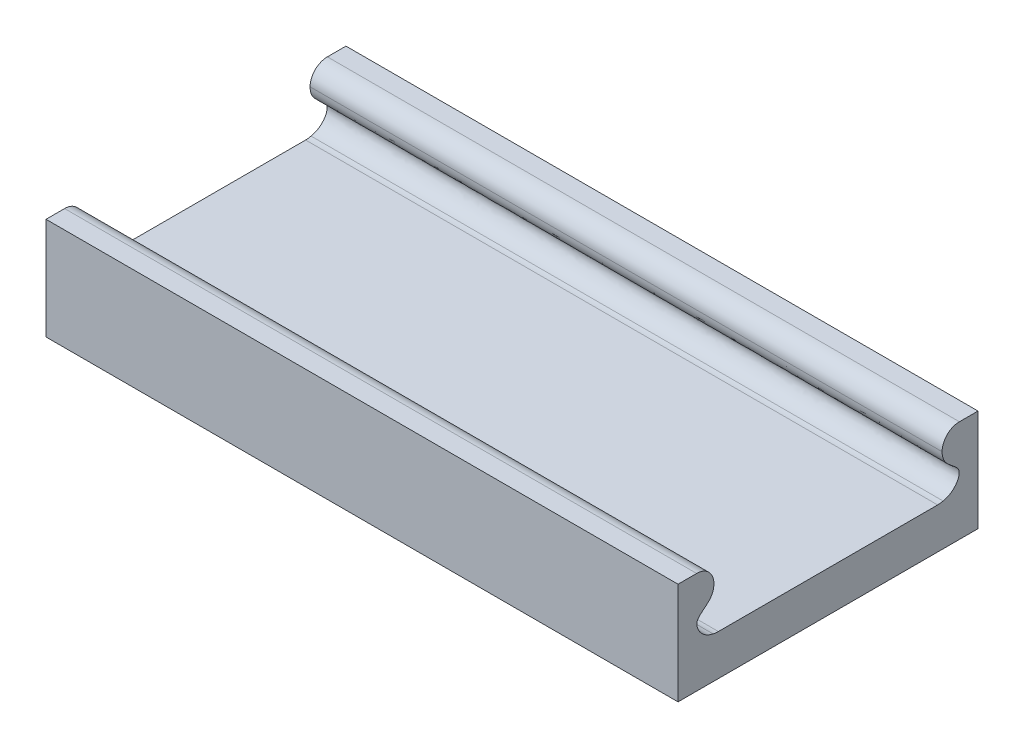
ISO-10303-21;
HEADER;
FILE_DESCRIPTION(('STEP AP214'),'2;1');
FILE_NAME('part.step','',(''),(''),'','','');
FILE_SCHEMA(('AUTOMOTIVE_DESIGN { 1 0 10303 214 1 1 1 1 }'));
ENDSEC;
DATA;
#1=APPLICATION_CONTEXT('core data for automotive mechanical design processes');
#2=APPLICATION_PROTOCOL_DEFINITION('international standard','automotive_design',2000,#1);
#3=PRODUCT_CONTEXT('',#1,'mechanical');
#4=PRODUCT('Part','Part','',(#3));
#5=PRODUCT_RELATED_PRODUCT_CATEGORY('part','',(#4));
#6=PRODUCT_DEFINITION_FORMATION('','',#4);
#7=PRODUCT_DEFINITION_CONTEXT('part definition',#1,'design');
#8=PRODUCT_DEFINITION('design','',#6,#7);
#9=PRODUCT_DEFINITION_SHAPE('','',#8);
#10=(LENGTH_UNIT() NAMED_UNIT(*) SI_UNIT(.MILLI.,.METRE.));
#11=(NAMED_UNIT(*) PLANE_ANGLE_UNIT() SI_UNIT($,.RADIAN.));
#12=(NAMED_UNIT(*) SI_UNIT($,.STERADIAN.) SOLID_ANGLE_UNIT());
#13=UNCERTAINTY_MEASURE_WITH_UNIT(LENGTH_MEASURE(1.E-05),#10,'distance_accuracy_value','');
#14=(GEOMETRIC_REPRESENTATION_CONTEXT(3) GLOBAL_UNCERTAINTY_ASSIGNED_CONTEXT((#13)) GLOBAL_UNIT_ASSIGNED_CONTEXT((#10,
#11,#12)) REPRESENTATION_CONTEXT('',''));
#15=CARTESIAN_POINT('',(0.,0.,0.));
#16=DIRECTION('',(0.,0.,1.));
#17=DIRECTION('',(1.,0.,0.));
#18=AXIS2_PLACEMENT_3D('',#15,#16,#17);
#19=CARTESIAN_POINT('',(73.824999924,9.88644672571332,15.3458333333333));
#20=DIRECTION('',(-1.,0.,0.));
#21=DIRECTION('',(0.,0.,1.));
#22=AXIS2_PLACEMENT_3D('',#19,#20,#21);
#23=CYLINDRICAL_SURFACE('',#22,2.01980327428668);
#24=CARTESIAN_POINT('',(0.,9.88644672571332,15.3458333333333));
#25=DIRECTION('',(1.,0.,0.));
#26=DIRECTION('',(0.,0.,-1.));
#27=AXIS2_PLACEMENT_3D('',#24,#25,#26);
#28=CIRCLE('',#27,2.01980327428668);
#29=CARTESIAN_POINT('',(0.,11.90625,15.3458333333333));
#30=VERTEX_POINT('',#29);
#31=CARTESIAN_POINT('',(0.,9.88644672571332,13.3260300590466));
#32=VERTEX_POINT('',#31);
#33=EDGE_CURVE('E191',#30,#32,#28,.F.);
#34=ORIENTED_EDGE('',*,*,#33,.F.);
#35=DIRECTION('',(-1.,0.,0.));
#36=VECTOR('',#35,1.);
#37=CARTESIAN_POINT('',(73.824999924,11.90625,15.3458333333333));
#38=LINE('',#37,#36);
#39=CARTESIAN_POINT('',(73.824999924,11.90625,15.3458333333333));
#40=VERTEX_POINT('',#39);
#41=EDGE_CURVE('E233',#40,#30,#38,.T.);
#42=ORIENTED_EDGE('',*,*,#41,.F.);
#43=CARTESIAN_POINT('',(73.824999924,9.88644672571332,15.3458333333333));
#44=DIRECTION('',(1.,0.,0.));
#45=DIRECTION('',(0.,0.,-1.));
#46=AXIS2_PLACEMENT_3D('',#43,#44,#45);
#47=CIRCLE('',#46,2.01980327428668);
#48=CARTESIAN_POINT('',(73.824999924,9.88644672571332,13.3260300590466));
#49=VERTEX_POINT('',#48);
#50=EDGE_CURVE('E147',#40,#49,#47,.F.);
#51=ORIENTED_EDGE('',*,*,#50,.T.);
#52=DIRECTION('',(-1.,0.,0.));
#53=VECTOR('',#52,1.);
#54=CARTESIAN_POINT('',(73.824999924,9.88644672571332,13.3260300590466));
#55=LINE('',#54,#53);
#56=EDGE_CURVE('E215',#49,#32,#55,.T.);
#57=ORIENTED_EDGE('',*,*,#56,.T.);
#58=EDGE_LOOP('',(#34,#42,#51,#57));
#59=FACE_BOUND('',#58,.T.);
#60=ADVANCED_FACE('F38',(#59),#23,.T.);
#61=CARTESIAN_POINT('',(73.824999924,11.90625,0.));
#62=DIRECTION('',(0.,1.,0.));
#63=DIRECTION('',(0.,0.,1.));
#64=AXIS2_PLACEMENT_3D('',#61,#62,#63);
#65=PLANE('',#64);
#66=DIRECTION('',(1.,0.,0.));
#67=VECTOR('',#66,1.);
#68=CARTESIAN_POINT('',(-3.17500007600001,11.90625,17.51875));
#69=LINE('',#68,#67);
#70=CARTESIAN_POINT('',(0.,11.90625,17.51875));
#71=VERTEX_POINT('',#70);
#72=CARTESIAN_POINT('',(73.824999924,11.90625,17.51875));
#73=VERTEX_POINT('',#72);
#74=EDGE_CURVE('E52',#71,#73,#69,.T.);
#75=ORIENTED_EDGE('',*,*,#74,.T.);
#76=DIRECTION('',(0.,0.,-1.));
#77=VECTOR('',#76,1.);
#78=CARTESIAN_POINT('',(73.824999924,11.90625,0.));
#79=LINE('',#78,#77);
#80=EDGE_CURVE('E139',#73,#40,#79,.T.);
#81=ORIENTED_EDGE('',*,*,#80,.T.);
#82=ORIENTED_EDGE('',*,*,#41,.T.);
#83=DIRECTION('',(0.,0.,-1.));
#84=VECTOR('',#83,1.);
#85=CARTESIAN_POINT('',(0.,11.90625,0.));
#86=LINE('',#85,#84);
#87=EDGE_CURVE('E190',#71,#30,#86,.T.);
#88=ORIENTED_EDGE('',*,*,#87,.F.);
#89=EDGE_LOOP('',(#75,#81,#82,#88));
#90=FACE_BOUND('',#89,.T.);
#91=ADVANCED_FACE('F180',(#90),#65,.T.);
#92=CARTESIAN_POINT('',(73.824999924,0.,0.));
#93=DIRECTION('',(0.,1.,0.));
#94=DIRECTION('',(0.,0.,1.));
#95=AXIS2_PLACEMENT_3D('',#92,#93,#94);
#96=PLANE('',#95);
#97=DIRECTION('',(0.,0.,-1.));
#98=VECTOR('',#97,1.);
#99=CARTESIAN_POINT('',(73.824999924,0.,0.));
#100=LINE('',#99,#98);
#101=CARTESIAN_POINT('',(73.824999924,0.,17.51875));
#102=VERTEX_POINT('',#101);
#103=CARTESIAN_POINT('',(73.824999924,0.,-17.51875));
#104=VERTEX_POINT('',#103);
#105=EDGE_CURVE('E137',#102,#104,#100,.T.);
#106=ORIENTED_EDGE('',*,*,#105,.F.);
#107=DIRECTION('',(1.,0.,0.));
#108=VECTOR('',#107,1.);
#109=CARTESIAN_POINT('',(-3.17500007600001,0.,17.51875));
#110=LINE('',#109,#108);
#111=CARTESIAN_POINT('',(0.,0.,17.51875));
#112=VERTEX_POINT('',#111);
#113=EDGE_CURVE('E123',#112,#102,#110,.T.);
#114=ORIENTED_EDGE('',*,*,#113,.F.);
#115=DIRECTION('',(0.,0.,-1.));
#116=VECTOR('',#115,1.);
#117=CARTESIAN_POINT('',(0.,0.,0.));
#118=LINE('',#117,#116);
#119=CARTESIAN_POINT('',(0.,0.,-17.51875));
#120=VERTEX_POINT('',#119);
#121=EDGE_CURVE('E237',#112,#120,#118,.T.);
#122=ORIENTED_EDGE('',*,*,#121,.T.);
#123=DIRECTION('',(1.,0.,0.));
#124=VECTOR('',#123,1.);
#125=CARTESIAN_POINT('',(-3.17500007600001,0.,-17.51875));
#126=LINE('',#125,#124);
#127=EDGE_CURVE('E59',#120,#104,#126,.T.);
#128=ORIENTED_EDGE('',*,*,#127,.T.);
#129=EDGE_LOOP('',(#106,#114,#122,#128));
#130=FACE_BOUND('',#129,.T.);
#131=ADVANCED_FACE('F141',(#130),#96,.F.);
#132=CARTESIAN_POINT('',(73.824999924,11.90625,0.));
#133=DIRECTION('',(0.,1.,0.));
#134=DIRECTION('',(0.,0.,1.));
#135=AXIS2_PLACEMENT_3D('',#132,#133,#134);
#136=PLANE('',#135);
#137=DIRECTION('',(1.,0.,0.));
#138=VECTOR('',#137,1.);
#139=CARTESIAN_POINT('',(-3.17500007600001,11.90625,-17.51875));
#140=LINE('',#139,#138);
#141=CARTESIAN_POINT('',(0.,11.90625,-17.51875));
#142=VERTEX_POINT('',#141);
#143=CARTESIAN_POINT('',(73.824999924,11.90625,-17.51875));
#144=VERTEX_POINT('',#143);
#145=EDGE_CURVE('E198',#142,#144,#140,.T.);
#146=ORIENTED_EDGE('',*,*,#145,.F.);
#147=DIRECTION('',(0.,0.,-1.));
#148=VECTOR('',#147,1.);
#149=CARTESIAN_POINT('',(0.,11.90625,0.));
#150=LINE('',#149,#148);
#151=CARTESIAN_POINT('',(0.,11.90625,-15.3458333333333));
#152=VERTEX_POINT('',#151);
#153=EDGE_CURVE('E240',#152,#142,#150,.T.);
#154=ORIENTED_EDGE('',*,*,#153,.F.);
#155=DIRECTION('',(-1.,0.,0.));
#156=VECTOR('',#155,1.);
#157=CARTESIAN_POINT('',(73.824999924,11.90625,-15.3458333333333));
#158=LINE('',#157,#156);
#159=CARTESIAN_POINT('',(73.824999924,11.90625,-15.3458333333333));
#160=VERTEX_POINT('',#159);
#161=EDGE_CURVE('E231',#160,#152,#158,.T.);
#162=ORIENTED_EDGE('',*,*,#161,.F.);
#163=DIRECTION('',(0.,0.,-1.));
#164=VECTOR('',#163,1.);
#165=CARTESIAN_POINT('',(73.824999924,11.90625,0.));
#166=LINE('',#165,#164);
#167=EDGE_CURVE('E142',#160,#144,#166,.T.);
#168=ORIENTED_EDGE('',*,*,#167,.T.);
#169=EDGE_LOOP('',(#146,#154,#162,#168));
#170=FACE_BOUND('',#169,.T.);
#171=ADVANCED_FACE('F174',(#170),#136,.T.);
#172=CARTESIAN_POINT('',(73.824999924,9.88644672571331,-15.3458333333333));
#173=DIRECTION('',(-1.,0.,0.));
#174=DIRECTION('',(0.,0.,1.));
#175=AXIS2_PLACEMENT_3D('',#172,#173,#174);
#176=CYLINDRICAL_SURFACE('',#175,2.01980327428668);
#177=CARTESIAN_POINT('',(0.,9.88644672571331,-15.3458333333333));
#178=DIRECTION('',(1.,0.,0.));
#179=DIRECTION('',(0.,0.,-1.));
#180=AXIS2_PLACEMENT_3D('',#177,#178,#179);
#181=CIRCLE('',#180,2.01980327428668);
#182=CARTESIAN_POINT('',(0.,9.88644672571332,-13.3260300590467));
#183=VERTEX_POINT('',#182);
#184=EDGE_CURVE('E243',#152,#183,#181,.T.);
#185=ORIENTED_EDGE('',*,*,#184,.T.);
#186=DIRECTION('',(-1.,0.,0.));
#187=VECTOR('',#186,1.);
#188=CARTESIAN_POINT('',(73.824999924,9.88644672571332,-13.3260300590467));
#189=LINE('',#188,#187);
#190=CARTESIAN_POINT('',(73.824999924,9.88644672571332,-13.3260300590467));
#191=VERTEX_POINT('',#190);
#192=EDGE_CURVE('E229',#191,#183,#189,.T.);
#193=ORIENTED_EDGE('',*,*,#192,.F.);
#194=CARTESIAN_POINT('',(73.824999924,9.88644672571331,-15.3458333333333));
#195=DIRECTION('',(1.,0.,0.));
#196=DIRECTION('',(0.,0.,-1.));
#197=AXIS2_PLACEMENT_3D('',#194,#195,#196);
#198=CIRCLE('',#197,2.01980327428668);
#199=EDGE_CURVE('E145',#160,#191,#198,.T.);
#200=ORIENTED_EDGE('',*,*,#199,.F.);
#201=ORIENTED_EDGE('',*,*,#161,.T.);
#202=EDGE_LOOP('',(#185,#193,#200,#201));
#203=FACE_BOUND('',#202,.T.);
#204=ADVANCED_FACE('F169',(#203),#176,.T.);
#205=CARTESIAN_POINT('',(73.824999924,4.84092627826629,-13.4282993696445));
#206=CARTESIAN_POINT('',(73.824999924,4.89728990837309,-13.7486767336852));
#207=CARTESIAN_POINT('',(73.824999924,5.11218530328561,-14.2862371792175));
#208=CARTESIAN_POINT('',(73.824999924,5.68271698665262,-14.9246676769609));
#209=CARTESIAN_POINT('',(73.824999924,6.32172282886224,-15.3058245681089));
#210=CARTESIAN_POINT('',(73.824999924,7.16334296254227,-15.3572432618043));
#211=CARTESIAN_POINT('',(73.824999924,8.14040605813312,-14.2238749566187));
#212=CARTESIAN_POINT('',(73.824999924,8.73624336588228,-13.334047481056));
#213=CARTESIAN_POINT('',(73.824999924,9.88644672571332,-13.3260300590466));
#214=B_SPLINE_CURVE_WITH_KNOTS('',3,(#205,#206,#207,#208,#209,#210,#211,#212,#213),
.UNSPECIFIED.,.F.,.F.,(4,1,1,1,1,1,4),(0.,0.146224431820352,0.253988964364943,0.37966821870452,
0.474367728490835,0.603388453608552,1.),.UNSPECIFIED.);
#215=DIRECTION('',(-1.,0.,0.));
#216=VECTOR('',#215,1.);
#217=SURFACE_OF_LINEAR_EXTRUSION('',#214,#216);
#218=CARTESIAN_POINT('',(0.,4.84092627826629,-13.4282993696445));
#219=CARTESIAN_POINT('',(0.,4.89728990837309,-13.7486767336852));
#220=CARTESIAN_POINT('',(0.,5.11218530328561,-14.2862371792175));
#221=CARTESIAN_POINT('',(0.,5.68271698665262,-14.9246676769609));
#222=CARTESIAN_POINT('',(0.,6.32172282886224,-15.3058245681089));
#223=CARTESIAN_POINT('',(0.,7.16334296254227,-15.3572432618043));
#224=CARTESIAN_POINT('',(0.,8.14040605813312,-14.2238749566187));
#225=CARTESIAN_POINT('',(0.,8.73624336588228,-13.334047481056));
#226=CARTESIAN_POINT('',(0.,9.88644672571332,-13.3260300590466));
#227=B_SPLINE_CURVE_WITH_KNOTS('',3,(#218,#219,#220,#221,#222,#223,#224,#225,#226),
.UNSPECIFIED.,.F.,.F.,(4,1,1,1,1,1,4),(0.,0.146224431820352,0.253988964364943,0.37966821870452,
0.474367728490835,0.603388453608552,1.),.UNSPECIFIED.);
#228=CARTESIAN_POINT('',(0.,4.84319313657928,-13.4409787903207));
#229=VERTEX_POINT('',#228);
#230=EDGE_CURVE('E249',#229,#183,#227,.T.);
#231=ORIENTED_EDGE('',*,*,#230,.F.);
#232=DIRECTION('',(-1.,0.,0.));
#233=VECTOR('',#232,1.);
#234=CARTESIAN_POINT('',(73.824999924,4.84319313657928,-13.4409787903207));
#235=LINE('',#234,#233);
#236=CARTESIAN_POINT('',(73.824999924,4.84319313657928,-13.4409787903207));
#237=VERTEX_POINT('',#236);
#238=EDGE_CURVE('E227',#237,#229,#235,.T.);
#239=ORIENTED_EDGE('',*,*,#238,.F.);
#240=EDGE_CURVE('E152',#237,#191,#214,.T.);
#241=ORIENTED_EDGE('',*,*,#240,.T.);
#242=ORIENTED_EDGE('',*,*,#192,.T.);
#243=EDGE_LOOP('',(#231,#239,#241,#242));
#244=FACE_BOUND('',#243,.T.);
#245=ADVANCED_FACE('F164',(#244),#217,.T.);
#246=CARTESIAN_POINT('',(73.824999924,7.30249999999999,-12.8058333333333));
#247=DIRECTION('',(-1.,0.,0.));
#248=DIRECTION('',(0.,0.,1.));
#249=AXIS2_PLACEMENT_3D('',#246,#247,#248);
#250=CYLINDRICAL_SURFACE('',#249,2.53999999999999);
#251=CARTESIAN_POINT('',(0.,7.30249999999999,-12.8058333333333));
#252=DIRECTION('',(1.,0.,0.));
#253=DIRECTION('',(0.,0.,-1.));
#254=AXIS2_PLACEMENT_3D('',#251,#252,#253);
#255=CIRCLE('',#254,2.53999999999999);
#256=CARTESIAN_POINT('',(0.,4.76250000000001,-12.8058333333333));
#257=VERTEX_POINT('',#256);
#258=EDGE_CURVE('E254',#257,#229,#255,.T.);
#259=ORIENTED_EDGE('',*,*,#258,.F.);
#260=DIRECTION('',(-1.,0.,0.));
#261=VECTOR('',#260,1.);
#262=CARTESIAN_POINT('',(73.824999924,4.76250000000001,-12.8058333333333));
#263=LINE('',#262,#261);
#264=CARTESIAN_POINT('',(73.824999924,4.76250000000001,-12.8058333333333));
#265=VERTEX_POINT('',#264);
#266=EDGE_CURVE('E225',#265,#257,#263,.T.);
#267=ORIENTED_EDGE('',*,*,#266,.F.);
#268=CARTESIAN_POINT('',(73.824999924,7.30249999999999,-12.8058333333333));
#269=DIRECTION('',(1.,0.,0.));
#270=DIRECTION('',(0.,0.,-1.));
#271=AXIS2_PLACEMENT_3D('',#268,#269,#270);
#272=CIRCLE('',#271,2.53999999999999);
#273=EDGE_CURVE('E158',#265,#237,#272,.T.);
#274=ORIENTED_EDGE('',*,*,#273,.T.);
#275=ORIENTED_EDGE('',*,*,#238,.T.);
#276=EDGE_LOOP('',(#259,#267,#274,#275));
#277=FACE_BOUND('',#276,.T.);
#278=ADVANCED_FACE('F168',(#277),#250,.F.);
#279=CARTESIAN_POINT('',(73.824999924,4.7625,0.));
#280=DIRECTION('',(0.,1.,0.));
#281=DIRECTION('',(0.,0.,1.));
#282=AXIS2_PLACEMENT_3D('',#279,#280,#281);
#283=PLANE('',#282);
#284=DIRECTION('',(0.,0.,-1.));
#285=VECTOR('',#284,1.);
#286=CARTESIAN_POINT('',(0.,4.7625,0.));
#287=LINE('',#286,#285);
#288=CARTESIAN_POINT('',(0.,4.7625,12.8058333333333));
#289=VERTEX_POINT('',#288);
#290=EDGE_CURVE('E209',#289,#257,#287,.T.);
#291=ORIENTED_EDGE('',*,*,#290,.F.);
#292=DIRECTION('',(-1.,0.,0.));
#293=VECTOR('',#292,1.);
#294=CARTESIAN_POINT('',(73.824999924,4.7625,12.8058333333333));
#295=LINE('',#294,#293);
#296=CARTESIAN_POINT('',(73.824999924,4.7625,12.8058333333333));
#297=VERTEX_POINT('',#296);
#298=EDGE_CURVE('E223',#297,#289,#295,.T.);
#299=ORIENTED_EDGE('',*,*,#298,.F.);
#300=DIRECTION('',(0.,0.,-1.));
#301=VECTOR('',#300,1.);
#302=CARTESIAN_POINT('',(73.824999924,4.7625,0.));
#303=LINE('',#302,#301);
#304=EDGE_CURVE('E268',#297,#265,#303,.T.);
#305=ORIENTED_EDGE('',*,*,#304,.T.);
#306=ORIENTED_EDGE('',*,*,#266,.T.);
#307=EDGE_LOOP('',(#291,#299,#305,#306));
#308=FACE_BOUND('',#307,.T.);
#309=ADVANCED_FACE('F264',(#308),#283,.T.);
#310=CARTESIAN_POINT('',(73.824999924,7.3025,12.8058333333333));
#311=DIRECTION('',(-1.,0.,0.));
#312=DIRECTION('',(0.,0.,1.));
#313=AXIS2_PLACEMENT_3D('',#310,#311,#312);
#314=CYLINDRICAL_SURFACE('',#313,2.54);
#315=CARTESIAN_POINT('',(0.,7.3025,12.8058333333333));
#316=DIRECTION('',(1.,0.,0.));
#317=DIRECTION('',(0.,0.,-1.));
#318=AXIS2_PLACEMENT_3D('',#315,#316,#317);
#319=CIRCLE('',#318,2.54);
#320=CARTESIAN_POINT('',(0.,4.84319313657926,13.4409787903207));
#321=VERTEX_POINT('',#320);
#322=EDGE_CURVE('E203',#289,#321,#319,.F.);
#323=ORIENTED_EDGE('',*,*,#322,.T.);
#324=DIRECTION('',(-1.,0.,0.));
#325=VECTOR('',#324,1.);
#326=CARTESIAN_POINT('',(73.824999924,4.84319313657926,13.4409787903207));
#327=LINE('',#326,#325);
#328=CARTESIAN_POINT('',(73.824999924,4.84319313657926,13.4409787903207));
#329=VERTEX_POINT('',#328);
#330=EDGE_CURVE('E220',#329,#321,#327,.T.);
#331=ORIENTED_EDGE('',*,*,#330,.F.);
#332=CARTESIAN_POINT('',(73.824999924,7.3025,12.8058333333333));
#333=DIRECTION('',(1.,0.,0.));
#334=DIRECTION('',(0.,0.,-1.));
#335=AXIS2_PLACEMENT_3D('',#332,#333,#334);
#336=CIRCLE('',#335,2.54);
#337=EDGE_CURVE('E278',#297,#329,#336,.F.);
#338=ORIENTED_EDGE('',*,*,#337,.F.);
#339=ORIENTED_EDGE('',*,*,#298,.T.);
#340=EDGE_LOOP('',(#323,#331,#338,#339));
#341=FACE_BOUND('',#340,.T.);
#342=ADVANCED_FACE('F292',(#341),#314,.F.);
#343=CARTESIAN_POINT('',(73.824999924,4.84092627826629,13.4282993696445));
#344=CARTESIAN_POINT('',(73.824999924,4.89728990837309,13.7486767336852));
#345=CARTESIAN_POINT('',(73.824999924,5.1121853032856,14.2862371792175));
#346=CARTESIAN_POINT('',(73.824999924,5.68271698665261,14.9246676769609));
#347=CARTESIAN_POINT('',(73.824999924,6.32172282886224,15.3058245681089));
#348=CARTESIAN_POINT('',(73.824999924,7.16334296254227,15.3572432618043));
#349=CARTESIAN_POINT('',(73.824999924,8.14040605813312,14.2238749566187));
#350=CARTESIAN_POINT('',(73.824999924,8.73624336588226,13.334047481056));
#351=CARTESIAN_POINT('',(73.824999924,9.88644672571332,13.3260300590466));
#352=B_SPLINE_CURVE_WITH_KNOTS('',3,(#343,#344,#345,#346,#347,#348,#349,#350,#351),
.UNSPECIFIED.,.F.,.F.,(4,1,1,1,1,1,4),(0.,0.146224431820352,0.253988964364943,0.37966821870452,
0.474367728490835,0.603388453608552,1.),.UNSPECIFIED.);
#353=DIRECTION('',(-1.,0.,0.));
#354=VECTOR('',#353,1.);
#355=SURFACE_OF_LINEAR_EXTRUSION('',#352,#354);
#356=CARTESIAN_POINT('',(0.,4.84092627826629,13.4282993696445));
#357=CARTESIAN_POINT('',(0.,4.89728990837309,13.7486767336852));
#358=CARTESIAN_POINT('',(0.,5.1121853032856,14.2862371792175));
#359=CARTESIAN_POINT('',(0.,5.68271698665261,14.9246676769609));
#360=CARTESIAN_POINT('',(0.,6.32172282886224,15.3058245681089));
#361=CARTESIAN_POINT('',(0.,7.16334296254227,15.3572432618043));
#362=CARTESIAN_POINT('',(0.,8.14040605813312,14.2238749566187));
#363=CARTESIAN_POINT('',(0.,8.73624336588226,13.334047481056));
#364=CARTESIAN_POINT('',(0.,9.88644672571332,13.3260300590466));
#365=B_SPLINE_CURVE_WITH_KNOTS('',3,(#356,#357,#358,#359,#360,#361,#362,#363,#364),
.UNSPECIFIED.,.F.,.F.,(4,1,1,1,1,1,4),(0.,0.146224431820352,0.253988964364943,0.37966821870452,
0.474367728490835,0.603388453608552,1.),.UNSPECIFIED.);
#366=EDGE_CURVE('E201',#321,#32,#365,.T.);
#367=ORIENTED_EDGE('',*,*,#366,.T.);
#368=ORIENTED_EDGE('',*,*,#56,.F.);
#369=EDGE_CURVE('E221',#329,#49,#352,.T.);
#370=ORIENTED_EDGE('',*,*,#369,.F.);
#371=ORIENTED_EDGE('',*,*,#330,.T.);
#372=EDGE_LOOP('',(#367,#368,#370,#371));
#373=FACE_BOUND('',#372,.T.);
#374=ADVANCED_FACE('F288',(#373),#355,.F.);
#375=CARTESIAN_POINT('',(73.824999924,0.,0.));
#376=DIRECTION('',(1.,0.,0.));
#377=DIRECTION('',(0.,0.,-1.));
#378=AXIS2_PLACEMENT_3D('',#375,#376,#377);
#379=PLANE('',#378);
#380=DIRECTION('',(0.,1.,0.));
#381=VECTOR('',#380,1.);
#382=CARTESIAN_POINT('',(73.824999924,11.90625,17.51875));
#383=LINE('',#382,#381);
#384=EDGE_CURVE('E126',#102,#73,#383,.T.);
#385=ORIENTED_EDGE('',*,*,#384,.F.);
#386=ORIENTED_EDGE('',*,*,#105,.T.);
#387=DIRECTION('',(0.,-1.,0.));
#388=VECTOR('',#387,1.);
#389=CARTESIAN_POINT('',(73.824999924,11.90625,-17.51875));
#390=LINE('',#389,#388);
#391=EDGE_CURVE('E196',#144,#104,#390,.T.);
#392=ORIENTED_EDGE('',*,*,#391,.F.);
#393=ORIENTED_EDGE('',*,*,#167,.F.);
#394=ORIENTED_EDGE('',*,*,#199,.T.);
#395=ORIENTED_EDGE('',*,*,#240,.F.);
#396=ORIENTED_EDGE('',*,*,#273,.F.);
#397=ORIENTED_EDGE('',*,*,#304,.F.);
#398=ORIENTED_EDGE('',*,*,#337,.T.);
#399=ORIENTED_EDGE('',*,*,#369,.T.);
#400=ORIENTED_EDGE('',*,*,#50,.F.);
#401=ORIENTED_EDGE('',*,*,#80,.F.);
#402=EDGE_LOOP('',(#385,#386,#392,#393,#394,#395,#396,#397,#398,#399,#400,#401));
#403=FACE_BOUND('',#402,.T.);
#404=ADVANCED_FACE('F135',(#403),#379,.T.);
#405=CARTESIAN_POINT('',(0.,0.,0.));
#406=DIRECTION('',(1.,0.,0.));
#407=DIRECTION('',(0.,0.,-1.));
#408=AXIS2_PLACEMENT_3D('',#405,#406,#407);
#409=PLANE('',#408);
#410=ORIENTED_EDGE('',*,*,#121,.F.);
#411=DIRECTION('',(0.,1.,0.));
#412=VECTOR('',#411,1.);
#413=CARTESIAN_POINT('',(0.,0.,17.51875));
#414=LINE('',#413,#412);
#415=EDGE_CURVE('E11',#112,#71,#414,.T.);
#416=ORIENTED_EDGE('',*,*,#415,.T.);
#417=ORIENTED_EDGE('',*,*,#87,.T.);
#418=ORIENTED_EDGE('',*,*,#33,.T.);
#419=ORIENTED_EDGE('',*,*,#366,.F.);
#420=ORIENTED_EDGE('',*,*,#322,.F.);
#421=ORIENTED_EDGE('',*,*,#290,.T.);
#422=ORIENTED_EDGE('',*,*,#258,.T.);
#423=ORIENTED_EDGE('',*,*,#230,.T.);
#424=ORIENTED_EDGE('',*,*,#184,.F.);
#425=ORIENTED_EDGE('',*,*,#153,.T.);
#426=DIRECTION('',(0.,-1.,0.));
#427=VECTOR('',#426,1.);
#428=CARTESIAN_POINT('',(0.,0.,-17.51875));
#429=LINE('',#428,#427);
#430=EDGE_CURVE('E45',#142,#120,#429,.T.);
#431=ORIENTED_EDGE('',*,*,#430,.T.);
#432=EDGE_LOOP('',(#410,#416,#417,#418,#419,#420,#421,#422,#423,#424,#425,#431));
#433=FACE_BOUND('',#432,.T.);
#434=ADVANCED_FACE('F236',(#433),#409,.F.);
#435=CARTESIAN_POINT('',(-3.17500007600001,11.90625,-17.51875));
#436=DIRECTION('',(0.,0.,1.));
#437=DIRECTION('',(1.,0.,0.));
#438=AXIS2_PLACEMENT_3D('',#435,#436,#437);
#439=PLANE('',#438);
#440=ORIENTED_EDGE('',*,*,#145,.T.);
#441=ORIENTED_EDGE('',*,*,#391,.T.);
#442=ORIENTED_EDGE('',*,*,#127,.F.);
#443=ORIENTED_EDGE('',*,*,#430,.F.);
#444=EDGE_LOOP('',(#440,#441,#442,#443));
#445=FACE_BOUND('',#444,.T.);
#446=ADVANCED_FACE('F277',(#445),#439,.F.);
#447=CARTESIAN_POINT('',(-3.17500007600001,11.90625,17.51875));
#448=DIRECTION('',(0.,0.,-1.));
#449=DIRECTION('',(-1.,0.,0.));
#450=AXIS2_PLACEMENT_3D('',#447,#448,#449);
#451=PLANE('',#450);
#452=ORIENTED_EDGE('',*,*,#113,.T.);
#453=ORIENTED_EDGE('',*,*,#384,.T.);
#454=ORIENTED_EDGE('',*,*,#74,.F.);
#455=ORIENTED_EDGE('',*,*,#415,.F.);
#456=EDGE_LOOP('',(#452,#453,#454,#455));
#457=FACE_BOUND('',#456,.T.);
#458=ADVANCED_FACE('F125',(#457),#451,.F.);
#459=CLOSED_SHELL('',(#60,#91,#131,#171,#204,#245,#278,#309,#342,#374,#404,#434,#446,#458));
#460=MANIFOLD_SOLID_BREP('B2',#459);
#461=ADVANCED_BREP_SHAPE_REPRESENTATION('',(#18,#460),#14);
#462=SHAPE_DEFINITION_REPRESENTATION(#9,#461);
ENDSEC;
END-ISO-10303-21;
